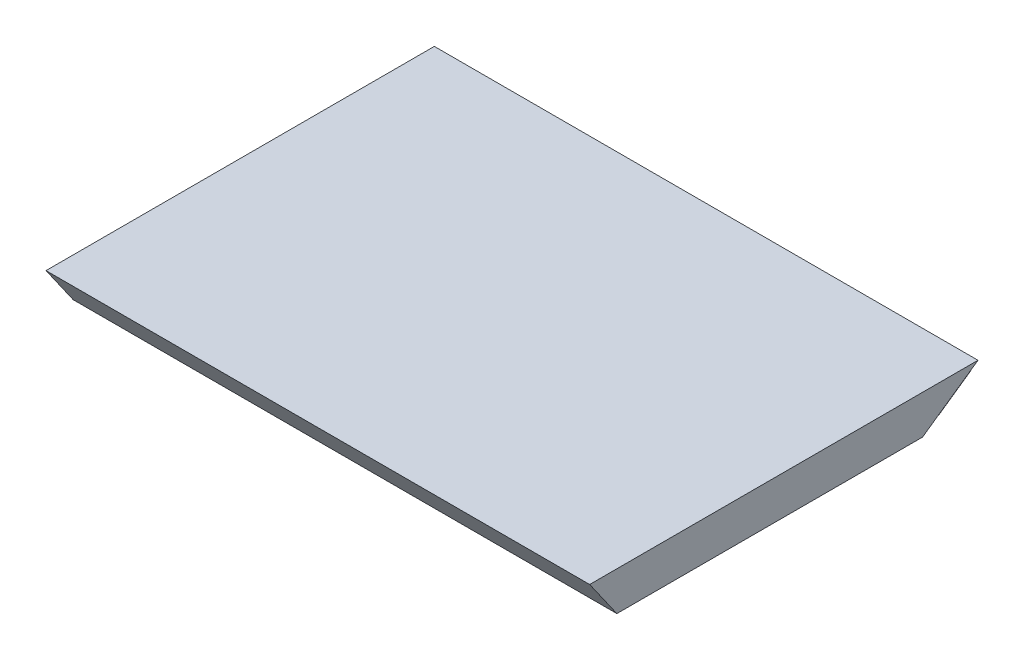
ISO-10303-21;
HEADER;
FILE_DESCRIPTION(('STEP AP214'),'2;1');
FILE_NAME('part.step','',(''),(''),'','','');
FILE_SCHEMA(('AUTOMOTIVE_DESIGN { 1 0 10303 214 1 1 1 1 }'));
ENDSEC;
DATA;
#1=APPLICATION_CONTEXT('core data for automotive mechanical design processes');
#2=APPLICATION_PROTOCOL_DEFINITION('international standard','automotive_design',2000,#1);
#3=PRODUCT_CONTEXT('',#1,'mechanical');
#4=PRODUCT('Part','Part','',(#3));
#5=PRODUCT_RELATED_PRODUCT_CATEGORY('part','',(#4));
#6=PRODUCT_DEFINITION_FORMATION('','',#4);
#7=PRODUCT_DEFINITION_CONTEXT('part definition',#1,'design');
#8=PRODUCT_DEFINITION('design','',#6,#7);
#9=PRODUCT_DEFINITION_SHAPE('','',#8);
#10=(LENGTH_UNIT() NAMED_UNIT(*) SI_UNIT(.MILLI.,.METRE.));
#11=(NAMED_UNIT(*) PLANE_ANGLE_UNIT() SI_UNIT($,.RADIAN.));
#12=(NAMED_UNIT(*) SI_UNIT($,.STERADIAN.) SOLID_ANGLE_UNIT());
#13=UNCERTAINTY_MEASURE_WITH_UNIT(LENGTH_MEASURE(1.E-05),#10,'distance_accuracy_value','');
#14=(GEOMETRIC_REPRESENTATION_CONTEXT(3) GLOBAL_UNCERTAINTY_ASSIGNED_CONTEXT((#13)) GLOBAL_UNIT_ASSIGNED_CONTEXT((#10,
#11,#12)) REPRESENTATION_CONTEXT('',''));
#15=CARTESIAN_POINT('',(0.,0.,0.));
#16=DIRECTION('',(0.,0.,1.));
#17=DIRECTION('',(1.,0.,0.));
#18=AXIS2_PLACEMENT_3D('',#15,#16,#17);
#19=CARTESIAN_POINT('',(44.45,3.175,0.));
#20=DIRECTION('',(0.,1.,0.));
#21=DIRECTION('',(0.,0.,1.));
#22=AXIS2_PLACEMENT_3D('',#19,#20,#21);
#23=PLANE('',#22);
#24=DIRECTION('',(0.,0.,-1.));
#25=VECTOR('',#24,1.);
#26=CARTESIAN_POINT('',(-44.45,3.175,0.));
#27=LINE('',#26,#25);
#28=CARTESIAN_POINT('',(-44.45,3.175,31.75));
#29=VERTEX_POINT('',#28);
#30=CARTESIAN_POINT('',(-44.45,3.175,-31.75));
#31=VERTEX_POINT('',#30);
#32=EDGE_CURVE('E122',#29,#31,#27,.T.);
#33=ORIENTED_EDGE('',*,*,#32,.F.);
#34=DIRECTION('',(-1.,0.,0.));
#35=VECTOR('',#34,1.);
#36=CARTESIAN_POINT('',(44.45,3.175,31.75));
#37=LINE('',#36,#35);
#38=CARTESIAN_POINT('',(44.45,3.175,31.75));
#39=VERTEX_POINT('',#38);
#40=EDGE_CURVE('E11',#39,#29,#37,.T.);
#41=ORIENTED_EDGE('',*,*,#40,.F.);
#42=DIRECTION('',(0.,0.,-1.));
#43=VECTOR('',#42,1.);
#44=CARTESIAN_POINT('',(44.45,3.175,0.));
#45=LINE('',#44,#43);
#46=CARTESIAN_POINT('',(44.45,3.175,-31.75));
#47=VERTEX_POINT('',#46);
#48=EDGE_CURVE('E171',#39,#47,#45,.T.);
#49=ORIENTED_EDGE('',*,*,#48,.T.);
#50=DIRECTION('',(-1.,0.,0.));
#51=VECTOR('',#50,1.);
#52=CARTESIAN_POINT('',(44.45,3.175,-31.75));
#53=LINE('',#52,#51);
#54=CARTESIAN_POINT('',(38.1,3.175,-31.75));
#55=VERTEX_POINT('',#54);
#56=EDGE_CURVE('E144',#47,#55,#53,.T.);
#57=ORIENTED_EDGE('',*,*,#56,.T.);
#58=DIRECTION('',(1.,0.,0.));
#59=VECTOR('',#58,1.);
#60=CARTESIAN_POINT('',(-38.1,3.175,-31.75));
#61=LINE('',#60,#59);
#62=CARTESIAN_POINT('',(-38.1,3.175,-31.75));
#63=VERTEX_POINT('',#62);
#64=EDGE_CURVE('E135',#63,#55,#61,.T.);
#65=ORIENTED_EDGE('',*,*,#64,.F.);
#66=EDGE_CURVE('E56',#63,#31,#53,.T.);
#67=ORIENTED_EDGE('',*,*,#66,.T.);
#68=EDGE_LOOP('',(#33,#41,#49,#57,#65,#67));
#69=FACE_BOUND('',#68,.T.);
#70=ADVANCED_FACE('F35',(#69),#23,.T.);
#71=CARTESIAN_POINT('',(44.45,-13.8730773325058,19.8128077397973));
#72=DIRECTION('',(0.,0.573576436351047,-0.819152044288991));
#73=DIRECTION('',(0.,0.819152044288991,0.573576436351047));
#74=AXIS2_PLACEMENT_3D('',#71,#72,#73);
#75=PLANE('',#74);
#76=DIRECTION('',(0.,-0.819152044288991,-0.573576436351047));
#77=VECTOR('',#76,1.);
#78=CARTESIAN_POINT('',(-44.45,-13.8730773325058,19.8128077397973));
#79=LINE('',#78,#77);
#80=CARTESIAN_POINT('',(-44.45,-3.175,27.3036821323683));
#81=VERTEX_POINT('',#80);
#82=EDGE_CURVE('E125',#29,#81,#79,.T.);
#83=ORIENTED_EDGE('',*,*,#82,.T.);
#84=DIRECTION('',(-1.,0.,0.));
#85=VECTOR('',#84,1.);
#86=CARTESIAN_POINT('',(44.45,-3.175,27.3036821323683));
#87=LINE('',#86,#85);
#88=CARTESIAN_POINT('',(44.45,-3.175,27.3036821323683));
#89=VERTEX_POINT('',#88);
#90=EDGE_CURVE('E44',#89,#81,#87,.T.);
#91=ORIENTED_EDGE('',*,*,#90,.F.);
#92=DIRECTION('',(0.,-0.819152044288991,-0.573576436351047));
#93=VECTOR('',#92,1.);
#94=CARTESIAN_POINT('',(44.45,-13.8730773325058,19.8128077397973));
#95=LINE('',#94,#93);
#96=EDGE_CURVE('E177',#39,#89,#95,.T.);
#97=ORIENTED_EDGE('',*,*,#96,.F.);
#98=ORIENTED_EDGE('',*,*,#40,.T.);
#99=EDGE_LOOP('',(#83,#91,#97,#98));
#100=FACE_BOUND('',#99,.T.);
#101=ADVANCED_FACE('F200',(#100),#75,.F.);
#102=CARTESIAN_POINT('',(44.45,-3.175,0.));
#103=DIRECTION('',(0.,1.,0.));
#104=DIRECTION('',(0.,0.,1.));
#105=AXIS2_PLACEMENT_3D('',#102,#103,#104);
#106=PLANE('',#105);
#107=DIRECTION('',(0.,0.,-1.));
#108=VECTOR('',#107,1.);
#109=CARTESIAN_POINT('',(-44.45,-3.175,0.));
#110=LINE('',#109,#108);
#111=CARTESIAN_POINT('',(-44.45,-3.175,-22.6812601571875));
#112=VERTEX_POINT('',#111);
#113=EDGE_CURVE('E162',#81,#112,#110,.T.);
#114=ORIENTED_EDGE('',*,*,#113,.T.);
#115=DIRECTION('',(-1.,0.,0.));
#116=VECTOR('',#115,1.);
#117=CARTESIAN_POINT('',(44.45,-3.175,-22.6812601571875));
#118=LINE('',#117,#116);
#119=CARTESIAN_POINT('',(44.45,-3.175,-22.6812601571875));
#120=VERTEX_POINT('',#119);
#121=EDGE_CURVE('E151',#120,#112,#118,.T.);
#122=ORIENTED_EDGE('',*,*,#121,.F.);
#123=DIRECTION('',(0.,0.,-1.));
#124=VECTOR('',#123,1.);
#125=CARTESIAN_POINT('',(44.45,-3.175,0.));
#126=LINE('',#125,#124);
#127=EDGE_CURVE('E164',#89,#120,#126,.T.);
#128=ORIENTED_EDGE('',*,*,#127,.F.);
#129=ORIENTED_EDGE('',*,*,#90,.T.);
#130=EDGE_LOOP('',(#114,#122,#128,#129));
#131=FACE_BOUND('',#130,.T.);
#132=ADVANCED_FACE('F160',(#131),#106,.F.);
#133=CARTESIAN_POINT('',(44.45,-12.7871633774467,-8.95366818920722));
#134=DIRECTION('',(0.,-0.819152044288995,-0.573576436351042));
#135=DIRECTION('',(0.,0.573576436351042,-0.819152044288995));
#136=AXIS2_PLACEMENT_3D('',#133,#134,#135);
#137=PLANE('',#136);
#138=DIRECTION('',(0.,0.573576436351042,-0.819152044288995));
#139=VECTOR('',#138,1.);
#140=CARTESIAN_POINT('',(-38.1,-0.467210370829113,-26.5483845187649));
#141=LINE('',#140,#139);
#142=CARTESIAN_POINT('',(-38.1,-0.467210370829113,-26.5483845187649));
#143=VERTEX_POINT('',#142);
#144=EDGE_CURVE('E38',#143,#63,#141,.T.);
#145=ORIENTED_EDGE('',*,*,#144,.F.);
#146=DIRECTION('',(-1.,0.,0.));
#147=VECTOR('',#146,1.);
#148=CARTESIAN_POINT('',(-38.1,-0.467210370829113,-26.5483845187649));
#149=LINE('',#148,#147);
#150=CARTESIAN_POINT('',(38.1,-0.467210370829113,-26.5483845187649));
#151=VERTEX_POINT('',#150);
#152=EDGE_CURVE('E119',#151,#143,#149,.T.);
#153=ORIENTED_EDGE('',*,*,#152,.F.);
#154=DIRECTION('',(0.,-0.573576436351042,0.819152044288995));
#155=VECTOR('',#154,1.);
#156=CARTESIAN_POINT('',(38.1,-0.467210370829113,-26.5483845187649));
#157=LINE('',#156,#155);
#158=EDGE_CURVE('E137',#55,#151,#157,.T.);
#159=ORIENTED_EDGE('',*,*,#158,.F.);
#160=ORIENTED_EDGE('',*,*,#56,.F.);
#161=DIRECTION('',(0.,-0.573576436351042,0.819152044288995));
#162=VECTOR('',#161,1.);
#163=CARTESIAN_POINT('',(44.45,-12.7871633774467,-8.95366818920722));
#164=LINE('',#163,#162);
#165=EDGE_CURVE('E145',#47,#120,#164,.T.);
#166=ORIENTED_EDGE('',*,*,#165,.T.);
#167=ORIENTED_EDGE('',*,*,#121,.T.);
#168=DIRECTION('',(0.,-0.573576436351042,0.819152044288995));
#169=VECTOR('',#168,1.);
#170=CARTESIAN_POINT('',(-44.45,-12.7871633774467,-8.95366818920722));
#171=LINE('',#170,#169);
#172=EDGE_CURVE('E149',#31,#112,#171,.T.);
#173=ORIENTED_EDGE('',*,*,#172,.F.);
#174=ORIENTED_EDGE('',*,*,#66,.F.);
#175=EDGE_LOOP('',(#145,#153,#159,#160,#166,#167,#173,#174));
#176=FACE_BOUND('',#175,.T.);
#177=ADVANCED_FACE('F193',(#176),#137,.T.);
#178=CARTESIAN_POINT('',(44.45,0.,0.));
#179=DIRECTION('',(1.,0.,0.));
#180=DIRECTION('',(0.,0.,-1.));
#181=AXIS2_PLACEMENT_3D('',#178,#179,#180);
#182=PLANE('',#181);
#183=ORIENTED_EDGE('',*,*,#48,.F.);
#184=ORIENTED_EDGE('',*,*,#96,.T.);
#185=ORIENTED_EDGE('',*,*,#127,.T.);
#186=ORIENTED_EDGE('',*,*,#165,.F.);
#187=EDGE_LOOP('',(#183,#184,#185,#186));
#188=FACE_BOUND('',#187,.T.);
#189=ADVANCED_FACE('F199',(#188),#182,.T.);
#190=CARTESIAN_POINT('',(-44.45,0.,0.));
#191=DIRECTION('',(1.,0.,0.));
#192=DIRECTION('',(0.,0.,-1.));
#193=AXIS2_PLACEMENT_3D('',#190,#191,#192);
#194=PLANE('',#193);
#195=ORIENTED_EDGE('',*,*,#32,.T.);
#196=ORIENTED_EDGE('',*,*,#172,.T.);
#197=ORIENTED_EDGE('',*,*,#113,.F.);
#198=ORIENTED_EDGE('',*,*,#82,.F.);
#199=EDGE_LOOP('',(#195,#196,#197,#198));
#200=FACE_BOUND('',#199,.T.);
#201=ADVANCED_FACE('F169',(#200),#194,.F.);
#202=CARTESIAN_POINT('',(-38.1,-7.74947204455828,-31.6474790379256));
#203=DIRECTION('',(1.,0.,0.));
#204=DIRECTION('',(0.,0.,-1.));
#205=AXIS2_PLACEMENT_3D('',#202,#203,#204);
#206=PLANE('',#205);
#207=ORIENTED_EDGE('',*,*,#144,.T.);
#208=DIRECTION('',(0.,0.819152044288995,0.573576436351042));
#209=VECTOR('',#208,1.);
#210=CARTESIAN_POINT('',(-38.1,-4.10726167372916,-36.8490945191608));
#211=LINE('',#210,#209);
#212=CARTESIAN_POINT('',(-38.1,-4.10726167372916,-36.8490945191608));
#213=VERTEX_POINT('',#212);
#214=EDGE_CURVE('E104',#213,#63,#211,.T.);
#215=ORIENTED_EDGE('',*,*,#214,.F.);
#216=DIRECTION('',(0.,0.573576436351042,-0.819152044288995));
#217=VECTOR('',#216,1.);
#218=CARTESIAN_POINT('',(-38.1,-7.74947204455828,-31.6474790379256));
#219=LINE('',#218,#217);
#220=CARTESIAN_POINT('',(-38.1,-7.74947204455828,-31.6474790379256));
#221=VERTEX_POINT('',#220);
#222=EDGE_CURVE('E110',#221,#213,#219,.T.);
#223=ORIENTED_EDGE('',*,*,#222,.F.);
#224=DIRECTION('',(0.,0.819152044288995,0.573576436351042));
#225=VECTOR('',#224,1.);
#226=CARTESIAN_POINT('',(-38.1,-7.74947204455828,-31.6474790379256));
#227=LINE('',#226,#225);
#228=EDGE_CURVE('E183',#221,#143,#227,.T.);
#229=ORIENTED_EDGE('',*,*,#228,.T.);
#230=EDGE_LOOP('',(#207,#215,#223,#229));
#231=FACE_BOUND('',#230,.T.);
#232=ADVANCED_FACE('F121',(#231),#206,.F.);
#233=CARTESIAN_POINT('',(-38.1,-4.10726167372916,-36.8490945191608));
#234=DIRECTION('',(0.,-0.573576436351042,0.819152044288995));
#235=DIRECTION('',(0.,-0.819152044288995,-0.573576436351042));
#236=AXIS2_PLACEMENT_3D('',#233,#234,#235);
#237=PLANE('',#236);
#238=ORIENTED_EDGE('',*,*,#64,.T.);
#239=DIRECTION('',(0.,0.819152044288995,0.573576436351042));
#240=VECTOR('',#239,1.);
#241=CARTESIAN_POINT('',(38.1,-4.10726167372916,-36.8490945191608));
#242=LINE('',#241,#240);
#243=CARTESIAN_POINT('',(38.1,-4.10726167372916,-36.8490945191608));
#244=VERTEX_POINT('',#243);
#245=EDGE_CURVE('E106',#244,#55,#242,.T.);
#246=ORIENTED_EDGE('',*,*,#245,.F.);
#247=DIRECTION('',(1.,0.,0.));
#248=VECTOR('',#247,1.);
#249=CARTESIAN_POINT('',(-38.1,-4.10726167372916,-36.8490945191608));
#250=LINE('',#249,#248);
#251=EDGE_CURVE('E99',#213,#244,#250,.T.);
#252=ORIENTED_EDGE('',*,*,#251,.F.);
#253=ORIENTED_EDGE('',*,*,#214,.T.);
#254=EDGE_LOOP('',(#238,#246,#252,#253));
#255=FACE_BOUND('',#254,.T.);
#256=ADVANCED_FACE('F102',(#255),#237,.F.);
#257=CARTESIAN_POINT('',(38.1,-7.74947204455828,-31.6474790379256));
#258=DIRECTION('',(-1.,0.,0.));
#259=DIRECTION('',(0.,0.,1.));
#260=AXIS2_PLACEMENT_3D('',#257,#258,#259);
#261=PLANE('',#260);
#262=ORIENTED_EDGE('',*,*,#158,.T.);
#263=DIRECTION('',(0.,0.819152044288995,0.573576436351042));
#264=VECTOR('',#263,1.);
#265=CARTESIAN_POINT('',(38.1,-7.74947204455828,-31.6474790379256));
#266=LINE('',#265,#264);
#267=CARTESIAN_POINT('',(38.1,-7.74947204455828,-31.6474790379256));
#268=VERTEX_POINT('',#267);
#269=EDGE_CURVE('E127',#268,#151,#266,.T.);
#270=ORIENTED_EDGE('',*,*,#269,.F.);
#271=DIRECTION('',(0.,-0.573576436351042,0.819152044288995));
#272=VECTOR('',#271,1.);
#273=CARTESIAN_POINT('',(38.1,-7.74947204455828,-31.6474790379256));
#274=LINE('',#273,#272);
#275=EDGE_CURVE('E109',#244,#268,#274,.T.);
#276=ORIENTED_EDGE('',*,*,#275,.F.);
#277=ORIENTED_EDGE('',*,*,#245,.T.);
#278=EDGE_LOOP('',(#262,#270,#276,#277));
#279=FACE_BOUND('',#278,.T.);
#280=ADVANCED_FACE('F190',(#279),#261,.F.);
#281=CARTESIAN_POINT('',(-38.1,-7.74947204455828,-31.6474790379256));
#282=DIRECTION('',(0.,0.573576436351042,-0.819152044288995));
#283=DIRECTION('',(0.,0.819152044288995,0.573576436351042));
#284=AXIS2_PLACEMENT_3D('',#281,#282,#283);
#285=PLANE('',#284);
#286=ORIENTED_EDGE('',*,*,#152,.T.);
#287=ORIENTED_EDGE('',*,*,#228,.F.);
#288=DIRECTION('',(-1.,0.,0.));
#289=VECTOR('',#288,1.);
#290=CARTESIAN_POINT('',(-38.1,-7.74947204455828,-31.6474790379256));
#291=LINE('',#290,#289);
#292=EDGE_CURVE('E115',#268,#221,#291,.T.);
#293=ORIENTED_EDGE('',*,*,#292,.F.);
#294=ORIENTED_EDGE('',*,*,#269,.T.);
#295=EDGE_LOOP('',(#286,#287,#293,#294));
#296=FACE_BOUND('',#295,.T.);
#297=ADVANCED_FACE('F192',(#296),#285,.F.);
#298=CARTESIAN_POINT('',(0.,-20.0694250511759,-14.052762708368));
#299=DIRECTION('',(0.,-0.819152044288995,-0.573576436351042));
#300=DIRECTION('',(0.,0.573576436351042,-0.819152044288995));
#301=AXIS2_PLACEMENT_3D('',#298,#299,#300);
#302=PLANE('',#301);
#303=ORIENTED_EDGE('',*,*,#222,.T.);
#304=ORIENTED_EDGE('',*,*,#251,.T.);
#305=ORIENTED_EDGE('',*,*,#275,.T.);
#306=ORIENTED_EDGE('',*,*,#292,.T.);
#307=EDGE_LOOP('',(#303,#304,#305,#306));
#308=FACE_BOUND('',#307,.T.);
#309=ADVANCED_FACE('F113',(#308),#302,.T.);
#310=CLOSED_SHELL('',(#70,#101,#132,#177,#189,#201,#232,#256,#280,#297,#309));
#311=MANIFOLD_SOLID_BREP('B2',#310);
#312=ADVANCED_BREP_SHAPE_REPRESENTATION('',(#18,#311),#14);
#313=SHAPE_DEFINITION_REPRESENTATION(#9,#312);
ENDSEC;
END-ISO-10303-21;
